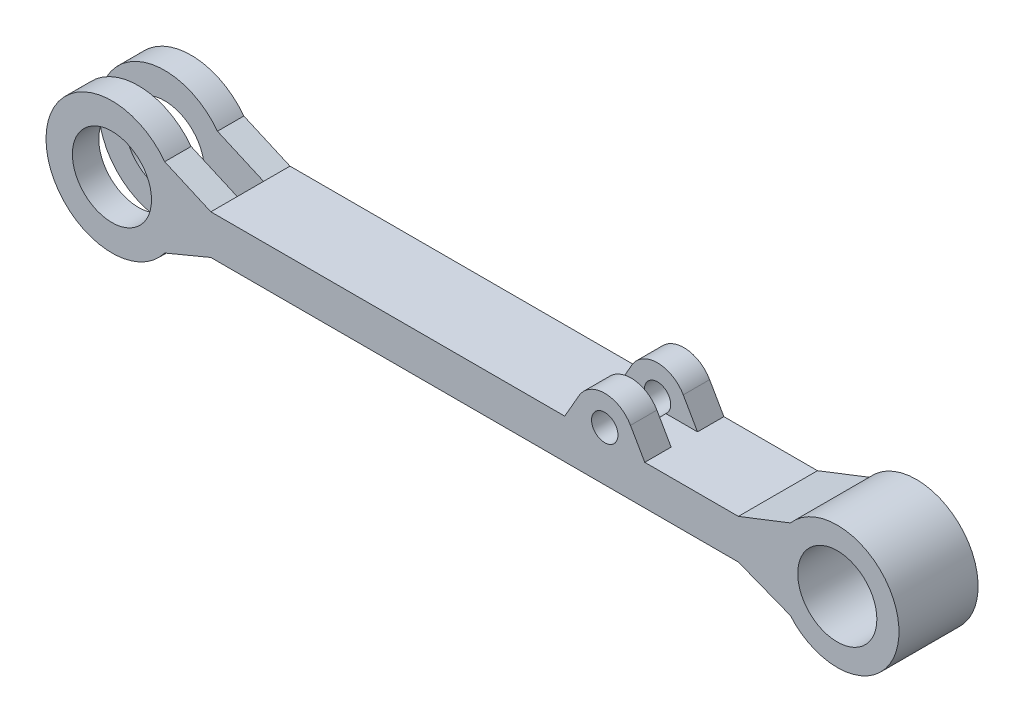
ISO-10303-21;
HEADER;
FILE_DESCRIPTION(('STEP AP214'),'2;1');
FILE_NAME('part.step','',(''),(''),'','','');
FILE_SCHEMA(('AUTOMOTIVE_DESIGN { 1 0 10303 214 1 1 1 1 }'));
ENDSEC;
DATA;
#1=APPLICATION_CONTEXT('core data for automotive mechanical design processes');
#2=APPLICATION_PROTOCOL_DEFINITION('international standard','automotive_design',2000,#1);
#3=PRODUCT_CONTEXT('',#1,'mechanical');
#4=PRODUCT('Part','Part','',(#3));
#5=PRODUCT_RELATED_PRODUCT_CATEGORY('part','',(#4));
#6=PRODUCT_DEFINITION_FORMATION('','',#4);
#7=PRODUCT_DEFINITION_CONTEXT('part definition',#1,'design');
#8=PRODUCT_DEFINITION('design','',#6,#7);
#9=PRODUCT_DEFINITION_SHAPE('','',#8);
#10=(LENGTH_UNIT() NAMED_UNIT(*) SI_UNIT(.MILLI.,.METRE.));
#11=(NAMED_UNIT(*) PLANE_ANGLE_UNIT() SI_UNIT($,.RADIAN.));
#12=(NAMED_UNIT(*) SI_UNIT($,.STERADIAN.) SOLID_ANGLE_UNIT());
#13=UNCERTAINTY_MEASURE_WITH_UNIT(LENGTH_MEASURE(1.E-05),#10,'distance_accuracy_value','');
#14=(GEOMETRIC_REPRESENTATION_CONTEXT(3) GLOBAL_UNCERTAINTY_ASSIGNED_CONTEXT((#13)) GLOBAL_UNIT_ASSIGNED_CONTEXT((#10,
#11,#12)) REPRESENTATION_CONTEXT('',''));
#15=CARTESIAN_POINT('',(0.,0.,0.));
#16=DIRECTION('',(0.,0.,1.));
#17=DIRECTION('',(1.,0.,0.));
#18=AXIS2_PLACEMENT_3D('',#15,#16,#17);
#19=CARTESIAN_POINT('',(103.610892498797,59.3559608649934,-67.7778317152681));
#20=DIRECTION('',(0.867702448143554,0.497083958185821,0.));
#21=DIRECTION('',(-0.497083958185821,0.867702448143554,0.));
#22=AXIS2_PLACEMENT_3D('',#19,#20,#21);
#23=PLANE('',#22);
#24=DIRECTION('',(-0.497083958185821,0.867702448143554,0.));
#25=VECTOR('',#24,1.);
#26=CARTESIAN_POINT('',(103.610892498797,59.3559608649934,20.));
#27=LINE('',#26,#25);
#28=CARTESIAN_POINT('',(129.021258279232,15.,20.));
#29=VERTEX_POINT('',#28);
#30=CARTESIAN_POINT('',(118.204825435634,33.8810061238425,20.));
#31=VERTEX_POINT('',#30);
#32=EDGE_CURVE('E218',#29,#31,#27,.T.);
#33=ORIENTED_EDGE('',*,*,#32,.F.);
#34=DIRECTION('',(0.,0.,1.));
#35=VECTOR('',#34,1.);
#36=CARTESIAN_POINT('',(129.021258279232,15.,-67.7778317152681));
#37=LINE('',#36,#35);
#38=CARTESIAN_POINT('',(129.021258279232,15.,0.));
#39=VERTEX_POINT('',#38);
#40=EDGE_CURVE('E228',#39,#29,#37,.T.);
#41=ORIENTED_EDGE('',*,*,#40,.F.);
#42=DIRECTION('',(0.497083958185821,-0.867702448143554,0.));
#43=VECTOR('',#42,1.);
#44=CARTESIAN_POINT('',(103.610892498797,59.3559608649934,0.));
#45=LINE('',#44,#43);
#46=CARTESIAN_POINT('',(118.204825435634,33.8810061238426,0.));
#47=VERTEX_POINT('',#46);
#48=EDGE_CURVE('E385',#47,#39,#45,.T.);
#49=ORIENTED_EDGE('',*,*,#48,.F.);
#50=DIRECTION('',(0.,0.,1.));
#51=VECTOR('',#50,1.);
#52=CARTESIAN_POINT('',(118.204825435634,33.8810061238425,-67.7778317152681));
#53=LINE('',#52,#51);
#54=EDGE_CURVE('E230',#47,#31,#53,.T.);
#55=ORIENTED_EDGE('',*,*,#54,.T.);
#56=EDGE_LOOP('',(#33,#41,#49,#55));
#57=FACE_BOUND('',#56,.T.);
#58=ADVANCED_FACE('F68',(#57),#23,.T.);
#59=CARTESIAN_POINT('',(98.681520352404,22.6966170646616,-67.7778317152681));
#60=DIRECTION('',(0.,0.,1.));
#61=DIRECTION('',(1.,0.,0.));
#62=AXIS2_PLACEMENT_3D('',#59,#60,#61);
#63=CYLINDRICAL_SURFACE('',#62,22.5);
#64=DIRECTION('',(0.,0.,1.));
#65=VECTOR('',#64,1.);
#66=CARTESIAN_POINT('',(79.1582152691702,33.8810061238359,-67.7778317152681));
#67=LINE('',#66,#65);
#68=CARTESIAN_POINT('',(79.1582152691702,33.8810061238359,0.));
#69=VERTEX_POINT('',#68);
#70=CARTESIAN_POINT('',(79.1582152691702,33.8810061238359,20.));
#71=VERTEX_POINT('',#70);
#72=EDGE_CURVE('E406',#69,#71,#67,.T.);
#73=ORIENTED_EDGE('',*,*,#72,.T.);
#74=CARTESIAN_POINT('',(98.681520352404,22.6966170646616,20.));
#75=DIRECTION('',(0.,0.,-1.));
#76=DIRECTION('',(0.,1.,0.));
#77=AXIS2_PLACEMENT_3D('',#74,#75,#76);
#78=CIRCLE('',#77,22.5);
#79=EDGE_CURVE('E232',#31,#71,#78,.F.);
#80=ORIENTED_EDGE('',*,*,#79,.F.);
#81=ORIENTED_EDGE('',*,*,#54,.F.);
#82=CARTESIAN_POINT('',(98.681520352404,22.6966170646616,0.));
#83=DIRECTION('',(0.,0.,1.));
#84=DIRECTION('',(1.,0.,0.));
#85=AXIS2_PLACEMENT_3D('',#82,#83,#84);
#86=CIRCLE('',#85,22.5);
#87=EDGE_CURVE('E387',#69,#47,#86,.F.);
#88=ORIENTED_EDGE('',*,*,#87,.F.);
#89=EDGE_LOOP('',(#73,#80,#81,#88));
#90=FACE_BOUND('',#89,.T.);
#91=ADVANCED_FACE('F446',(#90),#63,.T.);
#92=CARTESIAN_POINT('',(44.9852286719896,-25.7708567908174,-67.7778317152681));
#93=DIRECTION('',(-0.867702448143723,0.497083958185525,0.));
#94=DIRECTION('',(-0.497083958185526,-0.867702448143723,0.));
#95=AXIS2_PLACEMENT_3D('',#92,#93,#94);
#96=PLANE('',#95);
#97=DIRECTION('',(-0.497083958185526,-0.867702448143723,0.));
#98=VECTOR('',#97,1.);
#99=CARTESIAN_POINT('',(44.9852286719896,-25.7708567908174,20.));
#100=LINE('',#99,#98);
#101=CARTESIAN_POINT('',(68.3417824255845,15.,20.));
#102=VERTEX_POINT('',#101);
#103=EDGE_CURVE('E382',#71,#102,#100,.T.);
#104=ORIENTED_EDGE('',*,*,#103,.F.);
#105=ORIENTED_EDGE('',*,*,#72,.F.);
#106=DIRECTION('',(0.497083958185526,0.867702448143723,0.));
#107=VECTOR('',#106,1.);
#108=CARTESIAN_POINT('',(44.9852286719896,-25.7708567908174,0.));
#109=LINE('',#108,#107);
#110=CARTESIAN_POINT('',(68.3417824255845,15.,0.));
#111=VERTEX_POINT('',#110);
#112=EDGE_CURVE('E390',#111,#69,#109,.T.);
#113=ORIENTED_EDGE('',*,*,#112,.F.);
#114=DIRECTION('',(0.,0.,1.));
#115=VECTOR('',#114,1.);
#116=CARTESIAN_POINT('',(68.3417824255845,15.,-67.7778317152681));
#117=LINE('',#116,#115);
#118=EDGE_CURVE('E388',#111,#102,#117,.T.);
#119=ORIENTED_EDGE('',*,*,#118,.T.);
#120=EDGE_LOOP('',(#104,#105,#113,#119));
#121=FACE_BOUND('',#120,.T.);
#122=ADVANCED_FACE('F449',(#121),#96,.T.);
#123=CARTESIAN_POINT('',(0.,15.,60.));
#124=DIRECTION('',(0.,1.,0.));
#125=DIRECTION('',(0.,0.,1.));
#126=AXIS2_PLACEMENT_3D('',#123,#124,#125);
#127=PLANE('',#126);
#128=CARTESIAN_POINT('',(68.3417824255845,15.,40.));
#129=VERTEX_POINT('',#128);
#130=CARTESIAN_POINT('',(68.3417824255845,15.,60.));
#131=VERTEX_POINT('',#130);
#132=EDGE_CURVE('E405',#129,#131,#117,.T.);
#133=ORIENTED_EDGE('',*,*,#132,.F.);
#134=DIRECTION('',(-1.,0.,0.));
#135=VECTOR('',#134,1.);
#136=CARTESIAN_POINT('',(150.,15.,40.));
#137=LINE('',#136,#135);
#138=CARTESIAN_POINT('',(92.2970011254019,15.,40.));
#139=VERTEX_POINT('',#138);
#140=EDGE_CURVE('E89',#139,#129,#137,.T.);
#141=ORIENTED_EDGE('',*,*,#140,.F.);
#142=DIRECTION('',(0.,0.,1.));
#143=VECTOR('',#142,1.);
#144=CARTESIAN_POINT('',(92.2970011254019,15.,-67.7778317152681));
#145=LINE('',#144,#143);
#146=CARTESIAN_POINT('',(92.2970011254019,15.,20.));
#147=VERTEX_POINT('',#146);
#148=EDGE_CURVE('E358',#147,#139,#145,.T.);
#149=ORIENTED_EDGE('',*,*,#148,.F.);
#150=DIRECTION('',(-1.,0.,0.));
#151=VECTOR('',#150,1.);
#152=CARTESIAN_POINT('',(150.,15.,20.));
#153=LINE('',#152,#151);
#154=EDGE_CURVE('E83',#147,#102,#153,.T.);
#155=ORIENTED_EDGE('',*,*,#154,.T.);
#156=ORIENTED_EDGE('',*,*,#118,.F.);
#157=DIRECTION('',(1.,0.,0.));
#158=VECTOR('',#157,1.);
#159=CARTESIAN_POINT('',(0.,15.,0.));
#160=LINE('',#159,#158);
#161=CARTESIAN_POINT('',(-200.,15.,0.));
#162=VERTEX_POINT('',#161);
#163=EDGE_CURVE('E306',#162,#111,#160,.T.);
#164=ORIENTED_EDGE('',*,*,#163,.F.);
#165=DIRECTION('',(0.,0.,-1.));
#166=VECTOR('',#165,1.);
#167=CARTESIAN_POINT('',(-200.,15.,60.));
#168=LINE('',#167,#166);
#169=CARTESIAN_POINT('',(-200.,15.,20.));
#170=VERTEX_POINT('',#169);
#171=EDGE_CURVE('E336',#170,#162,#168,.T.);
#172=ORIENTED_EDGE('',*,*,#171,.F.);
#173=DIRECTION('',(0.,0.,-1.));
#174=VECTOR('',#173,1.);
#175=CARTESIAN_POINT('',(-200.,15.,60.));
#176=LINE('',#175,#174);
#177=CARTESIAN_POINT('',(-200.,15.,40.));
#178=VERTEX_POINT('',#177);
#179=EDGE_CURVE('E269',#178,#170,#176,.T.);
#180=ORIENTED_EDGE('',*,*,#179,.F.);
#181=CARTESIAN_POINT('',(-200.,15.,60.));
#182=VERTEX_POINT('',#181);
#183=EDGE_CURVE('E337',#182,#178,#168,.T.);
#184=ORIENTED_EDGE('',*,*,#183,.F.);
#185=DIRECTION('',(1.,0.,0.));
#186=VECTOR('',#185,1.);
#187=CARTESIAN_POINT('',(0.,15.,60.));
#188=LINE('',#187,#186);
#189=EDGE_CURVE('E282',#182,#131,#188,.T.);
#190=ORIENTED_EDGE('',*,*,#189,.T.);
#191=EDGE_LOOP('',(#133,#141,#149,#155,#156,#164,#172,#180,#184,#190));
#192=FACE_BOUND('',#191,.T.);
#193=ADVANCED_FACE('F451',(#192),#127,.T.);
#194=CARTESIAN_POINT('',(-26.9634776241674,-61.2162018685878,60.));
#195=DIRECTION('',(-0.40309364739888,-0.915158735644624,0.));
#196=DIRECTION('',(0.915158735644624,-0.40309364739888,0.));
#197=AXIS2_PLACEMENT_3D('',#194,#195,#196);
#198=PLANE('',#197);
#199=DIRECTION('',(0.,0.,-1.));
#200=VECTOR('',#199,1.);
#201=CARTESIAN_POINT('',(-234.992965725415,30.4131099208991,60.));
#202=LINE('',#201,#200);
#203=CARTESIAN_POINT('',(-234.992965725415,30.4131099208991,20.));
#204=VERTEX_POINT('',#203);
#205=CARTESIAN_POINT('',(-234.992965725415,30.4131099208991,0.));
#206=VERTEX_POINT('',#205);
#207=EDGE_CURVE('E332',#204,#206,#202,.T.);
#208=ORIENTED_EDGE('',*,*,#207,.F.);
#209=DIRECTION('',(0.915158735644624,-0.40309364739888,0.));
#210=VECTOR('',#209,1.);
#211=CARTESIAN_POINT('',(-26.9634776241674,-61.2162018685878,20.));
#212=LINE('',#211,#210);
#213=EDGE_CURVE('E263',#204,#170,#212,.T.);
#214=ORIENTED_EDGE('',*,*,#213,.T.);
#215=ORIENTED_EDGE('',*,*,#171,.T.);
#216=DIRECTION('',(-0.915158735644624,0.40309364739888,0.));
#217=VECTOR('',#216,1.);
#218=CARTESIAN_POINT('',(-26.9634776241674,-61.2162018685878,0.));
#219=LINE('',#218,#217);
#220=EDGE_CURVE('E309',#162,#206,#219,.T.);
#221=ORIENTED_EDGE('',*,*,#220,.T.);
#222=EDGE_LOOP('',(#208,#214,#215,#221));
#223=FACE_BOUND('',#222,.T.);
#224=ADVANCED_FACE('F457',(#223),#198,.F.);
#225=CARTESIAN_POINT('',(-24.2210743511929,58.1795586732475,60.));
#226=DIRECTION('',(0.384339432354501,-0.923191854782861,0.));
#227=DIRECTION('',(0.923191854782861,0.384339432354501,0.));
#228=AXIS2_PLACEMENT_3D('',#225,#226,#227);
#229=PLANE('',#228);
#230=DIRECTION('',(0.923191854782861,0.384339432354501,0.));
#231=VECTOR('',#230,1.);
#232=CARTESIAN_POINT('',(-24.2210743511929,58.1795586732475,20.));
#233=LINE('',#232,#231);
#234=CARTESIAN_POINT('',(-234.992965725415,-29.5681274305328,20.));
#235=VERTEX_POINT('',#234);
#236=CARTESIAN_POINT('',(-200.,-15.,20.));
#237=VERTEX_POINT('',#236);
#238=EDGE_CURVE('E261',#235,#237,#233,.T.);
#239=ORIENTED_EDGE('',*,*,#238,.F.);
#240=DIRECTION('',(0.,0.,-1.));
#241=VECTOR('',#240,1.);
#242=CARTESIAN_POINT('',(-234.992965725415,-29.5681274305328,60.));
#243=LINE('',#242,#241);
#244=CARTESIAN_POINT('',(-234.992965725415,-29.5681274305328,0.));
#245=VERTEX_POINT('',#244);
#246=EDGE_CURVE('E327',#235,#245,#243,.T.);
#247=ORIENTED_EDGE('',*,*,#246,.T.);
#248=DIRECTION('',(-0.923191854782861,-0.384339432354501,0.));
#249=VECTOR('',#248,1.);
#250=CARTESIAN_POINT('',(-24.2210743511929,58.1795586732475,0.));
#251=LINE('',#250,#249);
#252=CARTESIAN_POINT('',(-200.,-15.,0.));
#253=VERTEX_POINT('',#252);
#254=EDGE_CURVE('E312',#253,#245,#251,.T.);
#255=ORIENTED_EDGE('',*,*,#254,.F.);
#256=DIRECTION('',(0.,0.,-1.));
#257=VECTOR('',#256,1.);
#258=CARTESIAN_POINT('',(-200.,-15.,60.));
#259=LINE('',#258,#257);
#260=EDGE_CURVE('E323',#237,#253,#259,.T.);
#261=ORIENTED_EDGE('',*,*,#260,.F.);
#262=EDGE_LOOP('',(#239,#247,#255,#261));
#263=FACE_BOUND('',#262,.T.);
#264=ADVANCED_FACE('F483',(#263),#229,.T.);
#265=CARTESIAN_POINT('',(-275.,0.422491245183168,60.));
#266=DIRECTION('',(0.,0.,-1.));
#267=DIRECTION('',(-1.,0.,0.));
#268=AXIS2_PLACEMENT_3D('',#265,#266,#267);
#269=CYLINDRICAL_SURFACE('',#268,30.);
#270=CARTESIAN_POINT('',(-275.,0.422491245183168,20.));
#271=DIRECTION('',(0.,0.,-1.));
#272=DIRECTION('',(-1.,0.,0.));
#273=AXIS2_PLACEMENT_3D('',#270,#271,#272);
#274=CIRCLE('',#273,30.);
#275=CARTESIAN_POINT('',(-305.,0.422491245183168,20.));
#276=VERTEX_POINT('',#275);
#277=EDGE_CURVE('E266',#276,#276,#274,.T.);
#278=ORIENTED_EDGE('',*,*,#277,.F.);
#279=EDGE_LOOP('',(#278));
#280=FACE_BOUND('',#279,.T.);
#281=CARTESIAN_POINT('',(-275.,0.422491245183168,0.));
#282=DIRECTION('',(0.,0.,1.));
#283=DIRECTION('',(1.,0.,0.));
#284=AXIS2_PLACEMENT_3D('',#281,#282,#283);
#285=CIRCLE('',#284,30.);
#286=CARTESIAN_POINT('',(-245.,0.422491245183168,0.));
#287=VERTEX_POINT('',#286);
#288=EDGE_CURVE('E271',#287,#287,#285,.T.);
#289=ORIENTED_EDGE('',*,*,#288,.F.);
#290=EDGE_LOOP('',(#289));
#291=FACE_BOUND('',#290,.T.);
#292=ADVANCED_FACE('F494',(#280,#291),#269,.F.);
#293=CARTESIAN_POINT('',(-275.,0.422491245183168,60.));
#294=DIRECTION('',(0.,0.,-1.));
#295=DIRECTION('',(-1.,0.,0.));
#296=AXIS2_PLACEMENT_3D('',#293,#294,#295);
#297=CYLINDRICAL_SURFACE('',#296,50.);
#298=CARTESIAN_POINT('',(-275.,0.422491245183168,40.));
#299=DIRECTION('',(0.,0.,1.));
#300=DIRECTION('',(1.,0.,0.));
#301=AXIS2_PLACEMENT_3D('',#298,#299,#300);
#302=CIRCLE('',#301,50.);
#303=CARTESIAN_POINT('',(-234.992965725415,30.4131099208991,40.));
#304=VERTEX_POINT('',#303);
#305=CARTESIAN_POINT('',(-234.992965725415,-29.5681274305328,40.));
#306=VERTEX_POINT('',#305);
#307=EDGE_CURVE('E344',#304,#306,#302,.T.);
#308=ORIENTED_EDGE('',*,*,#307,.T.);
#309=CARTESIAN_POINT('',(-234.992965725415,-29.5681274305328,60.));
#310=VERTEX_POINT('',#309);
#311=EDGE_CURVE('E329',#310,#306,#243,.T.);
#312=ORIENTED_EDGE('',*,*,#311,.F.);
#313=CARTESIAN_POINT('',(-275.,0.422491245183168,60.));
#314=DIRECTION('',(0.,0.,1.));
#315=DIRECTION('',(1.,0.,0.));
#316=AXIS2_PLACEMENT_3D('',#313,#314,#315);
#317=CIRCLE('',#316,50.);
#318=CARTESIAN_POINT('',(-234.992965725415,30.4131099208991,60.));
#319=VERTEX_POINT('',#318);
#320=EDGE_CURVE('E300',#319,#310,#317,.T.);
#321=ORIENTED_EDGE('',*,*,#320,.F.);
#322=EDGE_CURVE('E333',#319,#304,#202,.T.);
#323=ORIENTED_EDGE('',*,*,#322,.T.);
#324=EDGE_LOOP('',(#308,#312,#321,#323));
#325=FACE_BOUND('',#324,.T.);
#326=ADVANCED_FACE('F492',(#325),#297,.T.);
#327=CARTESIAN_POINT('',(21.4128721619545,-54.7921611293644,60.));
#328=DIRECTION('',(-0.363993349481701,0.931401546881415,0.));
#329=DIRECTION('',(-0.931401546881415,-0.363993349481701,0.));
#330=AXIS2_PLACEMENT_3D('',#327,#328,#329);
#331=PLANE('',#330);
#332=DIRECTION('',(0.931401546881415,0.363993349481701,0.));
#333=VECTOR('',#332,1.);
#334=CARTESIAN_POINT('',(21.4128721619545,-54.7921611293644,0.));
#335=LINE('',#334,#333);
#336=CARTESIAN_POINT('',(200.,15.,0.));
#337=VERTEX_POINT('',#336);
#338=CARTESIAN_POINT('',(239.447282721468,30.416066908859,0.));
#339=VERTEX_POINT('',#338);
#340=EDGE_CURVE('E303',#337,#339,#335,.T.);
#341=ORIENTED_EDGE('',*,*,#340,.F.);
#342=DIRECTION('',(0.,0.,-1.));
#343=VECTOR('',#342,1.);
#344=CARTESIAN_POINT('',(200.,15.,60.));
#345=LINE('',#344,#343);
#346=CARTESIAN_POINT('',(200.,15.,60.));
#347=VERTEX_POINT('',#346);
#348=EDGE_CURVE('E340',#347,#337,#345,.T.);
#349=ORIENTED_EDGE('',*,*,#348,.F.);
#350=DIRECTION('',(0.931401546881415,0.363993349481701,0.));
#351=VECTOR('',#350,1.);
#352=CARTESIAN_POINT('',(21.4128721619545,-54.7921611293644,60.));
#353=LINE('',#352,#351);
#354=CARTESIAN_POINT('',(239.447282721468,30.416066908859,60.));
#355=VERTEX_POINT('',#354);
#356=EDGE_CURVE('E278',#347,#355,#353,.T.);
#357=ORIENTED_EDGE('',*,*,#356,.T.);
#358=DIRECTION('',(0.,0.,-1.));
#359=VECTOR('',#358,1.);
#360=CARTESIAN_POINT('',(239.447282721468,30.416066908859,60.));
#361=LINE('',#360,#359);
#362=EDGE_CURVE('E342',#355,#339,#361,.T.);
#363=ORIENTED_EDGE('',*,*,#362,.T.);
#364=EDGE_LOOP('',(#341,#349,#357,#363));
#365=FACE_BOUND('',#364,.T.);
#366=ADVANCED_FACE('F433',(#365),#331,.T.);
#367=ORIENTED_EDGE('',*,*,#40,.T.);
#368=CARTESIAN_POINT('',(105.066039579406,15.,20.));
#369=VERTEX_POINT('',#368);
#370=EDGE_CURVE('E215',#29,#369,#153,.T.);
#371=ORIENTED_EDGE('',*,*,#370,.T.);
#372=DIRECTION('',(0.,0.,1.));
#373=VECTOR('',#372,1.);
#374=CARTESIAN_POINT('',(105.066039579406,15.,-67.7778317152681));
#375=LINE('',#374,#373);
#376=CARTESIAN_POINT('',(105.066039579406,15.,40.));
#377=VERTEX_POINT('',#376);
#378=EDGE_CURVE('E12',#377,#369,#375,.F.);
#379=ORIENTED_EDGE('',*,*,#378,.F.);
#380=CARTESIAN_POINT('',(129.021258279232,15.,40.));
#381=VERTEX_POINT('',#380);
#382=EDGE_CURVE('E368',#381,#377,#137,.T.);
#383=ORIENTED_EDGE('',*,*,#382,.F.);
#384=CARTESIAN_POINT('',(129.021258279232,15.,60.));
#385=VERTEX_POINT('',#384);
#386=EDGE_CURVE('E239',#381,#385,#37,.T.);
#387=ORIENTED_EDGE('',*,*,#386,.T.);
#388=EDGE_CURVE('E281',#385,#347,#188,.T.);
#389=ORIENTED_EDGE('',*,*,#388,.T.);
#390=ORIENTED_EDGE('',*,*,#348,.T.);
#391=EDGE_CURVE('E236',#39,#337,#160,.T.);
#392=ORIENTED_EDGE('',*,*,#391,.F.);
#393=EDGE_LOOP('',(#367,#371,#379,#383,#387,#389,#390,#392));
#394=FACE_BOUND('',#393,.T.);
#395=ADVANCED_FACE('F234',(#394),#127,.T.);
#396=ORIENTED_EDGE('',*,*,#183,.T.);
#397=DIRECTION('',(-0.915158735644624,0.40309364739888,0.));
#398=VECTOR('',#397,1.);
#399=CARTESIAN_POINT('',(-26.9634776241674,-61.2162018685878,40.));
#400=LINE('',#399,#398);
#401=EDGE_CURVE('E255',#178,#304,#400,.T.);
#402=ORIENTED_EDGE('',*,*,#401,.T.);
#403=ORIENTED_EDGE('',*,*,#322,.F.);
#404=DIRECTION('',(-0.915158735644624,0.40309364739888,0.));
#405=VECTOR('',#404,1.);
#406=CARTESIAN_POINT('',(-26.9634776241674,-61.2162018685878,60.));
#407=LINE('',#406,#405);
#408=EDGE_CURVE('E285',#182,#319,#407,.T.);
#409=ORIENTED_EDGE('',*,*,#408,.F.);
#410=EDGE_LOOP('',(#396,#402,#403,#409));
#411=FACE_BOUND('',#410,.T.);
#412=ADVANCED_FACE('F464',(#411),#198,.F.);
#413=DIRECTION('',(-0.923191854782861,-0.384339432354501,0.));
#414=VECTOR('',#413,1.);
#415=CARTESIAN_POINT('',(-24.2210743511929,58.1795586732475,40.));
#416=LINE('',#415,#414);
#417=CARTESIAN_POINT('',(-200.,-15.,40.));
#418=VERTEX_POINT('',#417);
#419=EDGE_CURVE('E248',#418,#306,#416,.T.);
#420=ORIENTED_EDGE('',*,*,#419,.F.);
#421=CARTESIAN_POINT('',(-200.,-15.,60.));
#422=VERTEX_POINT('',#421);
#423=EDGE_CURVE('E324',#422,#418,#259,.T.);
#424=ORIENTED_EDGE('',*,*,#423,.F.);
#425=DIRECTION('',(-0.923191854782861,-0.384339432354501,0.));
#426=VECTOR('',#425,1.);
#427=CARTESIAN_POINT('',(-24.2210743511929,58.1795586732475,60.));
#428=LINE('',#427,#426);
#429=EDGE_CURVE('E288',#422,#310,#428,.T.);
#430=ORIENTED_EDGE('',*,*,#429,.T.);
#431=ORIENTED_EDGE('',*,*,#311,.T.);
#432=EDGE_LOOP('',(#420,#424,#430,#431));
#433=FACE_BOUND('',#432,.T.);
#434=ADVANCED_FACE('F470',(#433),#229,.T.);
#435=CARTESIAN_POINT('',(0.,-15.,60.));
#436=DIRECTION('',(0.,1.,0.));
#437=DIRECTION('',(-1.,0.,0.));
#438=AXIS2_PLACEMENT_3D('',#435,#436,#437);
#439=PLANE('',#438);
#440=DIRECTION('',(1.,0.,0.));
#441=VECTOR('',#440,1.);
#442=CARTESIAN_POINT('',(0.,-15.,0.));
#443=LINE('',#442,#441);
#444=CARTESIAN_POINT('',(200.,-15.,0.));
#445=VERTEX_POINT('',#444);
#446=EDGE_CURVE('E315',#253,#445,#443,.T.);
#447=ORIENTED_EDGE('',*,*,#446,.T.);
#448=DIRECTION('',(0.,0.,-1.));
#449=VECTOR('',#448,1.);
#450=CARTESIAN_POINT('',(200.,-15.,60.));
#451=LINE('',#450,#449);
#452=CARTESIAN_POINT('',(200.,-15.,60.));
#453=VERTEX_POINT('',#452);
#454=EDGE_CURVE('E320',#453,#445,#451,.T.);
#455=ORIENTED_EDGE('',*,*,#454,.F.);
#456=DIRECTION('',(1.,0.,0.));
#457=VECTOR('',#456,1.);
#458=CARTESIAN_POINT('',(0.,-15.,60.));
#459=LINE('',#458,#457);
#460=EDGE_CURVE('E291',#422,#453,#459,.T.);
#461=ORIENTED_EDGE('',*,*,#460,.F.);
#462=ORIENTED_EDGE('',*,*,#423,.T.);
#463=EDGE_CURVE('E328',#418,#237,#259,.T.);
#464=ORIENTED_EDGE('',*,*,#463,.T.);
#465=ORIENTED_EDGE('',*,*,#260,.T.);
#466=EDGE_LOOP('',(#447,#455,#461,#462,#464,#465));
#467=FACE_BOUND('',#466,.T.);
#468=ADVANCED_FACE('F475',(#467),#439,.F.);
#469=CARTESIAN_POINT('',(21.4128721619546,54.7921611293645,60.));
#470=DIRECTION('',(0.363993349481702,0.931401546881415,0.));
#471=DIRECTION('',(-0.931401546881415,0.363993349481702,0.));
#472=AXIS2_PLACEMENT_3D('',#469,#470,#471);
#473=PLANE('',#472);
#474=DIRECTION('',(0.931401546881415,-0.363993349481702,0.));
#475=VECTOR('',#474,1.);
#476=CARTESIAN_POINT('',(21.4128721619546,54.7921611293645,0.));
#477=LINE('',#476,#475);
#478=CARTESIAN_POINT('',(239.447282721468,-30.416066908859,0.));
#479=VERTEX_POINT('',#478);
#480=EDGE_CURVE('E276',#445,#479,#477,.T.);
#481=ORIENTED_EDGE('',*,*,#480,.T.);
#482=DIRECTION('',(0.,0.,-1.));
#483=VECTOR('',#482,1.);
#484=CARTESIAN_POINT('',(239.447282721468,-30.416066908859,60.));
#485=LINE('',#484,#483);
#486=CARTESIAN_POINT('',(239.447282721468,-30.416066908859,60.));
#487=VERTEX_POINT('',#486);
#488=EDGE_CURVE('E295',#487,#479,#485,.T.);
#489=ORIENTED_EDGE('',*,*,#488,.F.);
#490=DIRECTION('',(0.931401546881415,-0.363993349481702,0.));
#491=VECTOR('',#490,1.);
#492=CARTESIAN_POINT('',(21.4128721619546,54.7921611293645,60.));
#493=LINE('',#492,#491);
#494=EDGE_CURVE('E293',#453,#487,#493,.T.);
#495=ORIENTED_EDGE('',*,*,#494,.F.);
#496=ORIENTED_EDGE('',*,*,#454,.T.);
#497=EDGE_LOOP('',(#481,#489,#495,#496));
#498=FACE_BOUND('',#497,.T.);
#499=ADVANCED_FACE('F478',(#498),#473,.F.);
#500=CARTESIAN_POINT('',(275.,0.,60.));
#501=DIRECTION('',(0.,0.,-1.));
#502=DIRECTION('',(-1.,0.,0.));
#503=AXIS2_PLACEMENT_3D('',#500,#501,#502);
#504=CYLINDRICAL_SURFACE('',#503,46.788169787794);
#505=CARTESIAN_POINT('',(275.,0.,0.));
#506=DIRECTION('',(0.,0.,1.));
#507=DIRECTION('',(1.,0.,0.));
#508=AXIS2_PLACEMENT_3D('',#505,#506,#507);
#509=CIRCLE('',#508,46.788169787794);
#510=EDGE_CURVE('E299',#479,#339,#509,.T.);
#511=ORIENTED_EDGE('',*,*,#510,.T.);
#512=ORIENTED_EDGE('',*,*,#362,.F.);
#513=CARTESIAN_POINT('',(275.,0.,60.));
#514=DIRECTION('',(0.,0.,1.));
#515=DIRECTION('',(1.,0.,0.));
#516=AXIS2_PLACEMENT_3D('',#513,#514,#515);
#517=CIRCLE('',#516,46.788169787794);
#518=EDGE_CURVE('E275',#487,#355,#517,.T.);
#519=ORIENTED_EDGE('',*,*,#518,.F.);
#520=ORIENTED_EDGE('',*,*,#488,.T.);
#521=EDGE_LOOP('',(#511,#512,#519,#520));
#522=FACE_BOUND('',#521,.T.);
#523=ADVANCED_FACE('F439',(#522),#504,.T.);
#524=CARTESIAN_POINT('',(275.,0.,60.));
#525=DIRECTION('',(0.,0.,-1.));
#526=DIRECTION('',(-1.,0.,0.));
#527=AXIS2_PLACEMENT_3D('',#524,#525,#526);
#528=CYLINDRICAL_SURFACE('',#527,30.);
#529=CARTESIAN_POINT('',(275.,0.,60.));
#530=DIRECTION('',(0.,0.,1.));
#531=DIRECTION('',(1.,0.,0.));
#532=AXIS2_PLACEMENT_3D('',#529,#530,#531);
#533=CIRCLE('',#532,30.);
#534=CARTESIAN_POINT('',(305.,0.,60.));
#535=VERTEX_POINT('',#534);
#536=EDGE_CURVE('E272',#535,#535,#533,.T.);
#537=ORIENTED_EDGE('',*,*,#536,.T.);
#538=EDGE_LOOP('',(#537));
#539=FACE_BOUND('',#538,.T.);
#540=CARTESIAN_POINT('',(275.,0.,0.));
#541=DIRECTION('',(0.,0.,1.));
#542=DIRECTION('',(1.,0.,0.));
#543=AXIS2_PLACEMENT_3D('',#540,#541,#542);
#544=CIRCLE('',#543,30.);
#545=CARTESIAN_POINT('',(305.,0.,0.));
#546=VERTEX_POINT('',#545);
#547=EDGE_CURVE('E296',#546,#546,#544,.T.);
#548=ORIENTED_EDGE('',*,*,#547,.F.);
#549=EDGE_LOOP('',(#548));
#550=FACE_BOUND('',#549,.T.);
#551=ADVANCED_FACE('F529',(#539,#550),#528,.F.);
#552=CARTESIAN_POINT('',(0.,0.,0.));
#553=DIRECTION('',(0.,0.,1.));
#554=DIRECTION('',(1.,0.,0.));
#555=AXIS2_PLACEMENT_3D('',#552,#553,#554);
#556=PLANE('',#555);
#557=ORIENTED_EDGE('',*,*,#48,.T.);
#558=ORIENTED_EDGE('',*,*,#391,.T.);
#559=ORIENTED_EDGE('',*,*,#340,.T.);
#560=ORIENTED_EDGE('',*,*,#510,.F.);
#561=ORIENTED_EDGE('',*,*,#480,.F.);
#562=ORIENTED_EDGE('',*,*,#446,.F.);
#563=ORIENTED_EDGE('',*,*,#254,.T.);
#564=CARTESIAN_POINT('',(-275.,0.422491245183168,0.));
#565=DIRECTION('',(0.,0.,1.));
#566=DIRECTION('',(1.,0.,0.));
#567=AXIS2_PLACEMENT_3D('',#564,#565,#566);
#568=CIRCLE('',#567,50.);
#569=EDGE_CURVE('E348',#206,#245,#568,.T.);
#570=ORIENTED_EDGE('',*,*,#569,.F.);
#571=ORIENTED_EDGE('',*,*,#220,.F.);
#572=ORIENTED_EDGE('',*,*,#163,.T.);
#573=ORIENTED_EDGE('',*,*,#112,.T.);
#574=ORIENTED_EDGE('',*,*,#87,.T.);
#575=EDGE_LOOP('',(#557,#558,#559,#560,#561,#562,#563,#570,#571,#572,#573,#574));
#576=FACE_BOUND('',#575,.T.);
#577=ORIENTED_EDGE('',*,*,#547,.T.);
#578=EDGE_LOOP('',(#577));
#579=FACE_BOUND('',#578,.T.);
#580=CARTESIAN_POINT('',(98.681520352404,22.6966170646616,0.));
#581=DIRECTION('',(0.,0.,1.));
#582=DIRECTION('',(1.,0.,0.));
#583=AXIS2_PLACEMENT_3D('',#580,#581,#582);
#584=CIRCLE('',#583,9.99999999999999);
#585=CARTESIAN_POINT('',(108.681520352404,22.6966170646616,0.));
#586=VERTEX_POINT('',#585);
#587=EDGE_CURVE('E252',#586,#586,#584,.F.);
#588=ORIENTED_EDGE('',*,*,#587,.F.);
#589=EDGE_LOOP('',(#588));
#590=FACE_BOUND('',#589,.T.);
#591=ORIENTED_EDGE('',*,*,#288,.T.);
#592=EDGE_LOOP('',(#591));
#593=FACE_BOUND('',#592,.T.);
#594=ADVANCED_FACE('F443',(#576,#579,#590,#593),#556,.F.);
#595=CARTESIAN_POINT('',(0.,0.,60.));
#596=DIRECTION('',(0.,0.,1.));
#597=DIRECTION('',(1.,0.,0.));
#598=AXIS2_PLACEMENT_3D('',#595,#596,#597);
#599=PLANE('',#598);
#600=CARTESIAN_POINT('',(98.681520352404,22.6966170646616,60.));
#601=DIRECTION('',(0.,0.,1.));
#602=DIRECTION('',(1.,0.,0.));
#603=AXIS2_PLACEMENT_3D('',#600,#601,#602);
#604=CIRCLE('',#603,9.99999999999999);
#605=CARTESIAN_POINT('',(108.681520352404,22.6966170646616,60.));
#606=VERTEX_POINT('',#605);
#607=EDGE_CURVE('E231',#606,#606,#604,.T.);
#608=ORIENTED_EDGE('',*,*,#607,.F.);
#609=EDGE_LOOP('',(#608));
#610=FACE_BOUND('',#609,.T.);
#611=ORIENTED_EDGE('',*,*,#536,.F.);
#612=EDGE_LOOP('',(#611));
#613=FACE_BOUND('',#612,.T.);
#614=ORIENTED_EDGE('',*,*,#518,.T.);
#615=ORIENTED_EDGE('',*,*,#356,.F.);
#616=ORIENTED_EDGE('',*,*,#388,.F.);
#617=DIRECTION('',(-0.497083958185821,0.867702448143554,0.));
#618=VECTOR('',#617,1.);
#619=CARTESIAN_POINT('',(103.610892498797,59.3559608649934,60.));
#620=LINE('',#619,#618);
#621=CARTESIAN_POINT('',(118.204825435634,33.8810061238425,60.));
#622=VERTEX_POINT('',#621);
#623=EDGE_CURVE('E396',#385,#622,#620,.T.);
#624=ORIENTED_EDGE('',*,*,#623,.T.);
#625=CARTESIAN_POINT('',(98.681520352404,22.6966170646616,60.));
#626=DIRECTION('',(0.,0.,1.));
#627=DIRECTION('',(1.,0.,0.));
#628=AXIS2_PLACEMENT_3D('',#625,#626,#627);
#629=CIRCLE('',#628,22.5);
#630=CARTESIAN_POINT('',(79.1582152691702,33.8810061238359,60.));
#631=VERTEX_POINT('',#630);
#632=EDGE_CURVE('E399',#622,#631,#629,.T.);
#633=ORIENTED_EDGE('',*,*,#632,.T.);
#634=DIRECTION('',(-0.497083958185526,-0.867702448143723,0.));
#635=VECTOR('',#634,1.);
#636=CARTESIAN_POINT('',(44.9852286719896,-25.7708567908174,60.));
#637=LINE('',#636,#635);
#638=EDGE_CURVE('E242',#631,#131,#637,.T.);
#639=ORIENTED_EDGE('',*,*,#638,.T.);
#640=ORIENTED_EDGE('',*,*,#189,.F.);
#641=ORIENTED_EDGE('',*,*,#408,.T.);
#642=ORIENTED_EDGE('',*,*,#320,.T.);
#643=ORIENTED_EDGE('',*,*,#429,.F.);
#644=ORIENTED_EDGE('',*,*,#460,.T.);
#645=ORIENTED_EDGE('',*,*,#494,.T.);
#646=EDGE_LOOP('',(#614,#615,#616,#624,#633,#639,#640,#641,#642,#643,#644,#645));
#647=FACE_BOUND('',#646,.T.);
#648=CARTESIAN_POINT('',(-275.,0.422491245183168,60.));
#649=DIRECTION('',(0.,0.,1.));
#650=DIRECTION('',(1.,0.,0.));
#651=AXIS2_PLACEMENT_3D('',#648,#649,#650);
#652=CIRCLE('',#651,30.);
#653=CARTESIAN_POINT('',(-245.,0.422491245183168,60.));
#654=VERTEX_POINT('',#653);
#655=EDGE_CURVE('E345',#654,#654,#652,.T.);
#656=ORIENTED_EDGE('',*,*,#655,.F.);
#657=EDGE_LOOP('',(#656));
#658=FACE_BOUND('',#657,.T.);
#659=ADVANCED_FACE('F423',(#610,#613,#647,#658),#599,.T.);
#660=CARTESIAN_POINT('',(-275.,0.422491245183168,40.));
#661=DIRECTION('',(0.,0.,1.));
#662=DIRECTION('',(1.,0.,0.));
#663=AXIS2_PLACEMENT_3D('',#660,#661,#662);
#664=CIRCLE('',#663,30.);
#665=CARTESIAN_POINT('',(-245.,0.422491245183168,40.));
#666=VERTEX_POINT('',#665);
#667=EDGE_CURVE('E258',#666,#666,#664,.T.);
#668=ORIENTED_EDGE('',*,*,#667,.F.);
#669=EDGE_LOOP('',(#668));
#670=FACE_BOUND('',#669,.T.);
#671=ORIENTED_EDGE('',*,*,#655,.T.);
#672=EDGE_LOOP('',(#671));
#673=FACE_BOUND('',#672,.T.);
#674=ADVANCED_FACE('F501',(#670,#673),#269,.F.);
#675=CARTESIAN_POINT('',(-275.,0.422491245183168,20.));
#676=DIRECTION('',(0.,0.,-1.));
#677=DIRECTION('',(-1.,0.,0.));
#678=AXIS2_PLACEMENT_3D('',#675,#676,#677);
#679=CIRCLE('',#678,50.);
#680=EDGE_CURVE('E356',#235,#204,#679,.T.);
#681=ORIENTED_EDGE('',*,*,#680,.T.);
#682=ORIENTED_EDGE('',*,*,#207,.T.);
#683=ORIENTED_EDGE('',*,*,#569,.T.);
#684=ORIENTED_EDGE('',*,*,#246,.F.);
#685=EDGE_LOOP('',(#681,#682,#683,#684));
#686=FACE_BOUND('',#685,.T.);
#687=ADVANCED_FACE('F70',(#686),#297,.T.);
#688=CARTESIAN_POINT('',(-200.,-55.,0.));
#689=DIRECTION('',(-1.,0.,0.));
#690=DIRECTION('',(0.,0.,1.));
#691=AXIS2_PLACEMENT_3D('',#688,#689,#690);
#692=PLANE('',#691);
#693=ORIENTED_EDGE('',*,*,#179,.T.);
#694=DIRECTION('',(0.,1.,0.));
#695=VECTOR('',#694,1.);
#696=CARTESIAN_POINT('',(-200.,-55.,20.));
#697=LINE('',#696,#695);
#698=EDGE_CURVE('E245',#237,#170,#697,.T.);
#699=ORIENTED_EDGE('',*,*,#698,.F.);
#700=ORIENTED_EDGE('',*,*,#463,.F.);
#701=DIRECTION('',(0.,1.,0.));
#702=VECTOR('',#701,1.);
#703=CARTESIAN_POINT('',(-200.,-55.,40.));
#704=LINE('',#703,#702);
#705=EDGE_CURVE('E249',#418,#178,#704,.T.);
#706=ORIENTED_EDGE('',*,*,#705,.T.);
#707=EDGE_LOOP('',(#693,#699,#700,#706));
#708=FACE_BOUND('',#707,.T.);
#709=ADVANCED_FACE('F488',(#708),#692,.T.);
#710=CARTESIAN_POINT('',(0.,-55.,20.));
#711=DIRECTION('',(0.,0.,-1.));
#712=DIRECTION('',(-1.,0.,0.));
#713=AXIS2_PLACEMENT_3D('',#710,#711,#712);
#714=PLANE('',#713);
#715=ORIENTED_EDGE('',*,*,#277,.T.);
#716=EDGE_LOOP('',(#715));
#717=FACE_BOUND('',#716,.T.);
#718=ORIENTED_EDGE('',*,*,#213,.F.);
#719=ORIENTED_EDGE('',*,*,#680,.F.);
#720=ORIENTED_EDGE('',*,*,#238,.T.);
#721=ORIENTED_EDGE('',*,*,#698,.T.);
#722=EDGE_LOOP('',(#718,#719,#720,#721));
#723=FACE_BOUND('',#722,.T.);
#724=ADVANCED_FACE('F487',(#717,#723),#714,.F.);
#725=CARTESIAN_POINT('',(0.,-55.,40.));
#726=DIRECTION('',(0.,0.,1.));
#727=DIRECTION('',(1.,0.,0.));
#728=AXIS2_PLACEMENT_3D('',#725,#726,#727);
#729=PLANE('',#728);
#730=ORIENTED_EDGE('',*,*,#667,.T.);
#731=EDGE_LOOP('',(#730));
#732=FACE_BOUND('',#731,.T.);
#733=ORIENTED_EDGE('',*,*,#705,.F.);
#734=ORIENTED_EDGE('',*,*,#419,.T.);
#735=ORIENTED_EDGE('',*,*,#307,.F.);
#736=ORIENTED_EDGE('',*,*,#401,.F.);
#737=EDGE_LOOP('',(#733,#734,#735,#736));
#738=FACE_BOUND('',#737,.T.);
#739=ADVANCED_FACE('F491',(#732,#738),#729,.F.);
#740=DIRECTION('',(0.497083958185821,-0.867702448143554,0.));
#741=VECTOR('',#740,1.);
#742=CARTESIAN_POINT('',(103.610892498797,59.3559608649934,40.));
#743=LINE('',#742,#741);
#744=CARTESIAN_POINT('',(118.204825435634,33.8810061238425,40.));
#745=VERTEX_POINT('',#744);
#746=EDGE_CURVE('E373',#745,#381,#743,.T.);
#747=ORIENTED_EDGE('',*,*,#746,.F.);
#748=EDGE_CURVE('E238',#745,#622,#53,.T.);
#749=ORIENTED_EDGE('',*,*,#748,.T.);
#750=ORIENTED_EDGE('',*,*,#623,.F.);
#751=ORIENTED_EDGE('',*,*,#386,.F.);
#752=EDGE_LOOP('',(#747,#749,#750,#751));
#753=FACE_BOUND('',#752,.T.);
#754=ADVANCED_FACE('F429',(#753),#23,.T.);
#755=CARTESIAN_POINT('',(98.681520352404,22.6966170646616,40.));
#756=DIRECTION('',(0.,0.,1.));
#757=DIRECTION('',(1.,0.,0.));
#758=AXIS2_PLACEMENT_3D('',#755,#756,#757);
#759=CIRCLE('',#758,22.5);
#760=CARTESIAN_POINT('',(79.1582152691702,33.8810061238359,40.));
#761=VERTEX_POINT('',#760);
#762=EDGE_CURVE('E377',#761,#745,#759,.F.);
#763=ORIENTED_EDGE('',*,*,#762,.F.);
#764=EDGE_CURVE('E408',#761,#631,#67,.T.);
#765=ORIENTED_EDGE('',*,*,#764,.T.);
#766=ORIENTED_EDGE('',*,*,#632,.F.);
#767=ORIENTED_EDGE('',*,*,#748,.F.);
#768=EDGE_LOOP('',(#763,#765,#766,#767));
#769=FACE_BOUND('',#768,.T.);
#770=ADVANCED_FACE('F416',(#769),#63,.T.);
#771=DIRECTION('',(0.497083958185526,0.867702448143723,0.));
#772=VECTOR('',#771,1.);
#773=CARTESIAN_POINT('',(44.9852286719896,-25.7708567908174,40.));
#774=LINE('',#773,#772);
#775=EDGE_CURVE('E374',#129,#761,#774,.T.);
#776=ORIENTED_EDGE('',*,*,#775,.F.);
#777=ORIENTED_EDGE('',*,*,#132,.T.);
#778=ORIENTED_EDGE('',*,*,#638,.F.);
#779=ORIENTED_EDGE('',*,*,#764,.F.);
#780=EDGE_LOOP('',(#776,#777,#778,#779));
#781=FACE_BOUND('',#780,.T.);
#782=ADVANCED_FACE('F420',(#781),#96,.T.);
#783=CARTESIAN_POINT('',(98.681520352404,22.6966170646616,-67.7778317152681));
#784=DIRECTION('',(0.,0.,1.));
#785=DIRECTION('',(1.,0.,0.));
#786=AXIS2_PLACEMENT_3D('',#783,#784,#785);
#787=CYLINDRICAL_SURFACE('',#786,9.99999999999999);
#788=CARTESIAN_POINT('',(98.681520352404,22.6966170646616,40.));
#789=DIRECTION('',(0.,0.,1.));
#790=DIRECTION('',(1.,0.,0.));
#791=AXIS2_PLACEMENT_3D('',#788,#789,#790);
#792=CIRCLE('',#791,9.99999999999999);
#793=EDGE_CURVE('E361',#139,#377,#792,.F.);
#794=ORIENTED_EDGE('',*,*,#793,.T.);
#795=ORIENTED_EDGE('',*,*,#378,.T.);
#796=CARTESIAN_POINT('',(98.681520352404,22.6966170646616,20.));
#797=DIRECTION('',(0.,0.,-1.));
#798=DIRECTION('',(0.,1.,0.));
#799=AXIS2_PLACEMENT_3D('',#796,#797,#798);
#800=CIRCLE('',#799,9.99999999999999);
#801=EDGE_CURVE('E76',#369,#147,#800,.F.);
#802=ORIENTED_EDGE('',*,*,#801,.T.);
#803=ORIENTED_EDGE('',*,*,#148,.T.);
#804=EDGE_LOOP('',(#794,#795,#802,#803));
#805=FACE_BOUND('',#804,.T.);
#806=ORIENTED_EDGE('',*,*,#607,.T.);
#807=EDGE_LOOP('',(#806));
#808=FACE_BOUND('',#807,.T.);
#809=ORIENTED_EDGE('',*,*,#587,.T.);
#810=EDGE_LOOP('',(#809));
#811=FACE_BOUND('',#810,.T.);
#812=ADVANCED_FACE('F364',(#805,#808,#811),#787,.F.);
#813=CARTESIAN_POINT('',(150.,45.1966170646616,20.));
#814=DIRECTION('',(0.,0.,-1.));
#815=DIRECTION('',(0.,1.,0.));
#816=AXIS2_PLACEMENT_3D('',#813,#814,#815);
#817=PLANE('',#816);
#818=ORIENTED_EDGE('',*,*,#32,.T.);
#819=ORIENTED_EDGE('',*,*,#79,.T.);
#820=ORIENTED_EDGE('',*,*,#103,.T.);
#821=ORIENTED_EDGE('',*,*,#154,.F.);
#822=ORIENTED_EDGE('',*,*,#801,.F.);
#823=ORIENTED_EDGE('',*,*,#370,.F.);
#824=EDGE_LOOP('',(#818,#819,#820,#821,#822,#823));
#825=FACE_BOUND('',#824,.T.);
#826=ADVANCED_FACE('F217',(#825),#817,.F.);
#827=CARTESIAN_POINT('',(150.,15.,40.));
#828=DIRECTION('',(0.,0.,1.));
#829=DIRECTION('',(1.,0.,0.));
#830=AXIS2_PLACEMENT_3D('',#827,#828,#829);
#831=PLANE('',#830);
#832=ORIENTED_EDGE('',*,*,#746,.T.);
#833=ORIENTED_EDGE('',*,*,#382,.T.);
#834=ORIENTED_EDGE('',*,*,#793,.F.);
#835=ORIENTED_EDGE('',*,*,#140,.T.);
#836=ORIENTED_EDGE('',*,*,#775,.T.);
#837=ORIENTED_EDGE('',*,*,#762,.T.);
#838=EDGE_LOOP('',(#832,#833,#834,#835,#836,#837));
#839=FACE_BOUND('',#838,.T.);
#840=ADVANCED_FACE('F371',(#839),#831,.F.);
#841=CLOSED_SHELL('',(#58,#91,#122,#193,#224,#264,#292,#326,#366,#395,#412,#434,#468,#499,#523,
#551,#594,#659,#674,#687,#709,#724,#739,#754,#770,#782,#812,#826,#840));
#842=MANIFOLD_SOLID_BREP('B2',#841);
#843=ADVANCED_BREP_SHAPE_REPRESENTATION('',(#18,#842),#14);
#844=SHAPE_DEFINITION_REPRESENTATION(#9,#843);
ENDSEC;
END-ISO-10303-21;
